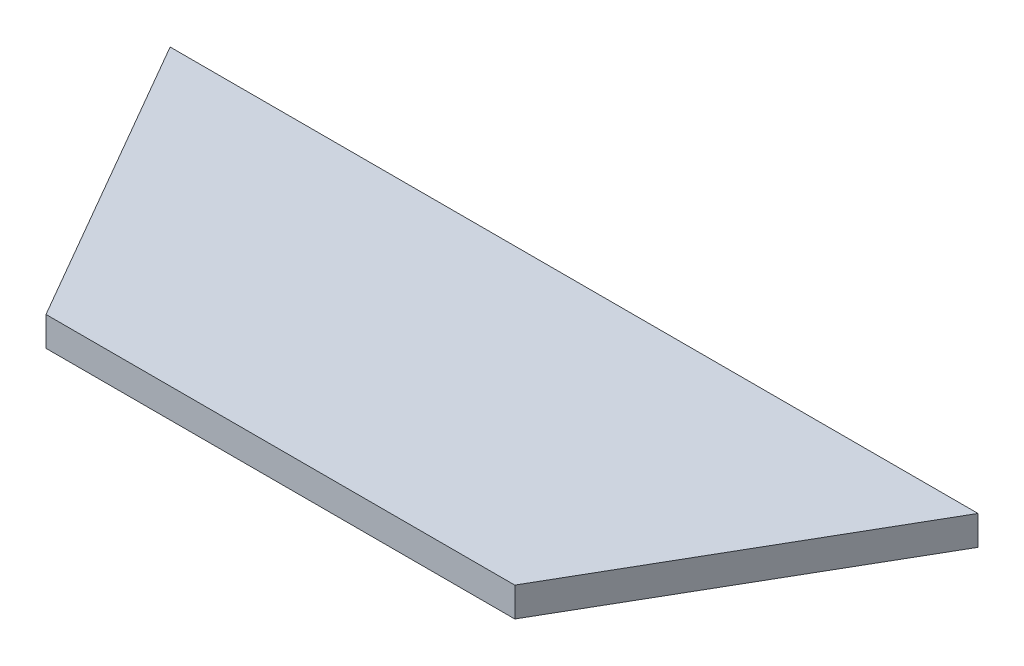
ISO-10303-21;
HEADER;
FILE_DESCRIPTION(('STEP AP214'),'2;1');
FILE_NAME('part.step','',(''),(''),'','','');
FILE_SCHEMA(('AUTOMOTIVE_DESIGN { 1 0 10303 214 1 1 1 1 }'));
ENDSEC;
DATA;
#1=APPLICATION_CONTEXT('core data for automotive mechanical design processes');
#2=APPLICATION_PROTOCOL_DEFINITION('international standard','automotive_design',2000,#1);
#3=PRODUCT_CONTEXT('',#1,'mechanical');
#4=PRODUCT('Part','Part','',(#3));
#5=PRODUCT_RELATED_PRODUCT_CATEGORY('part','',(#4));
#6=PRODUCT_DEFINITION_FORMATION('','',#4);
#7=PRODUCT_DEFINITION_CONTEXT('part definition',#1,'design');
#8=PRODUCT_DEFINITION('design','',#6,#7);
#9=PRODUCT_DEFINITION_SHAPE('','',#8);
#10=(LENGTH_UNIT() NAMED_UNIT(*) SI_UNIT(.MILLI.,.METRE.));
#11=(NAMED_UNIT(*) PLANE_ANGLE_UNIT() SI_UNIT($,.RADIAN.));
#12=(NAMED_UNIT(*) SI_UNIT($,.STERADIAN.) SOLID_ANGLE_UNIT());
#13=UNCERTAINTY_MEASURE_WITH_UNIT(LENGTH_MEASURE(1.E-05),#10,'distance_accuracy_value','');
#14=(GEOMETRIC_REPRESENTATION_CONTEXT(3) GLOBAL_UNCERTAINTY_ASSIGNED_CONTEXT((#13)) GLOBAL_UNIT_ASSIGNED_CONTEXT((#10,
#11,#12)) REPRESENTATION_CONTEXT('',''));
#15=CARTESIAN_POINT('',(0.,0.,0.));
#16=DIRECTION('',(0.,0.,1.));
#17=DIRECTION('',(1.,0.,0.));
#18=AXIS2_PLACEMENT_3D('',#15,#16,#17);
#19=CARTESIAN_POINT('',(-28.8675134594811,5.,-50.));
#20=DIRECTION('',(0.86602540378444,0.,-0.499999999999998));
#21=DIRECTION('',(-0.499999999999998,0.,-0.86602540378444));
#22=AXIS2_PLACEMENT_3D('',#19,#20,#21);
#23=PLANE('',#22);
#24=DIRECTION('',(0.499999999999998,0.,0.86602540378444));
#25=VECTOR('',#24,1.);
#26=CARTESIAN_POINT('',(-28.8675134594811,0.,-50.));
#27=LINE('',#26,#25);
#28=CARTESIAN_POINT('',(-28.8675134594811,0.,-50.));
#29=VERTEX_POINT('',#28);
#30=CARTESIAN_POINT('',(0.,0.,0.));
#31=VERTEX_POINT('',#30);
#32=EDGE_CURVE('E96',#29,#31,#27,.T.);
#33=ORIENTED_EDGE('',*,*,#32,.T.);
#34=DIRECTION('',(0.,-1.,0.));
#35=VECTOR('',#34,1.);
#36=CARTESIAN_POINT('',(0.,5.,0.));
#37=LINE('',#36,#35);
#38=CARTESIAN_POINT('',(0.,5.,0.));
#39=VERTEX_POINT('',#38);
#40=EDGE_CURVE('E11',#39,#31,#37,.T.);
#41=ORIENTED_EDGE('',*,*,#40,.F.);
#42=DIRECTION('',(0.499999999999998,0.,0.86602540378444));
#43=VECTOR('',#42,1.);
#44=CARTESIAN_POINT('',(-28.8675134594811,5.,-50.));
#45=LINE('',#44,#43);
#46=CARTESIAN_POINT('',(-28.8675134594811,5.,-50.));
#47=VERTEX_POINT('',#46);
#48=EDGE_CURVE('E84',#47,#39,#45,.T.);
#49=ORIENTED_EDGE('',*,*,#48,.F.);
#50=DIRECTION('',(0.,-1.,0.));
#51=VECTOR('',#50,1.);
#52=CARTESIAN_POINT('',(-28.8675134594811,5.,-50.));
#53=LINE('',#52,#51);
#54=EDGE_CURVE('E92',#47,#29,#53,.T.);
#55=ORIENTED_EDGE('',*,*,#54,.T.);
#56=EDGE_LOOP('',(#33,#41,#49,#55));
#57=FACE_BOUND('',#56,.T.);
#58=ADVANCED_FACE('F33',(#57),#23,.F.);
#59=CARTESIAN_POINT('',(0.,5.,0.));
#60=DIRECTION('',(0.,0.,-1.));
#61=DIRECTION('',(-1.,0.,0.));
#62=AXIS2_PLACEMENT_3D('',#59,#60,#61);
#63=PLANE('',#62);
#64=DIRECTION('',(1.,0.,0.));
#65=VECTOR('',#64,1.);
#66=CARTESIAN_POINT('',(0.,0.,0.));
#67=LINE('',#66,#65);
#68=CARTESIAN_POINT('',(79.81197846,0.,0.));
#69=VERTEX_POINT('',#68);
#70=EDGE_CURVE('E88',#31,#69,#67,.T.);
#71=ORIENTED_EDGE('',*,*,#70,.T.);
#72=DIRECTION('',(0.,-1.,0.));
#73=VECTOR('',#72,1.);
#74=CARTESIAN_POINT('',(79.81197846,5.,0.));
#75=LINE('',#74,#73);
#76=CARTESIAN_POINT('',(79.81197846,5.,0.));
#77=VERTEX_POINT('',#76);
#78=EDGE_CURVE('E41',#77,#69,#75,.T.);
#79=ORIENTED_EDGE('',*,*,#78,.F.);
#80=DIRECTION('',(1.,0.,0.));
#81=VECTOR('',#80,1.);
#82=CARTESIAN_POINT('',(0.,5.,0.));
#83=LINE('',#82,#81);
#84=EDGE_CURVE('E79',#39,#77,#83,.T.);
#85=ORIENTED_EDGE('',*,*,#84,.F.);
#86=ORIENTED_EDGE('',*,*,#40,.T.);
#87=EDGE_LOOP('',(#71,#79,#85,#86));
#88=FACE_BOUND('',#87,.T.);
#89=ADVANCED_FACE('F87',(#88),#63,.F.);
#90=CARTESIAN_POINT('',(79.81197846,5.,0.));
#91=DIRECTION('',(-0.86602540378444,0.,-0.499999999999998));
#92=DIRECTION('',(-0.499999999999998,0.,0.86602540378444));
#93=AXIS2_PLACEMENT_3D('',#90,#91,#92);
#94=PLANE('',#93);
#95=DIRECTION('',(0.499999999999998,0.,-0.86602540378444));
#96=VECTOR('',#95,1.);
#97=CARTESIAN_POINT('',(79.81197846,0.,0.));
#98=LINE('',#97,#96);
#99=CARTESIAN_POINT('',(108.679491919481,0.,-50.));
#100=VERTEX_POINT('',#99);
#101=EDGE_CURVE('E66',#69,#100,#98,.T.);
#102=ORIENTED_EDGE('',*,*,#101,.T.);
#103=DIRECTION('',(0.,-1.,0.));
#104=VECTOR('',#103,1.);
#105=CARTESIAN_POINT('',(108.679491919481,5.,-50.));
#106=LINE('',#105,#104);
#107=CARTESIAN_POINT('',(108.679491919481,5.,-50.));
#108=VERTEX_POINT('',#107);
#109=EDGE_CURVE('E89',#108,#100,#106,.T.);
#110=ORIENTED_EDGE('',*,*,#109,.F.);
#111=DIRECTION('',(0.499999999999998,0.,-0.86602540378444));
#112=VECTOR('',#111,1.);
#113=CARTESIAN_POINT('',(79.81197846,5.,0.));
#114=LINE('',#113,#112);
#115=EDGE_CURVE('E82',#77,#108,#114,.T.);
#116=ORIENTED_EDGE('',*,*,#115,.F.);
#117=ORIENTED_EDGE('',*,*,#78,.T.);
#118=EDGE_LOOP('',(#102,#110,#116,#117));
#119=FACE_BOUND('',#118,.T.);
#120=ADVANCED_FACE('F90',(#119),#94,.F.);
#121=CARTESIAN_POINT('',(108.679491919481,5.,-50.));
#122=DIRECTION('',(0.,0.,1.));
#123=DIRECTION('',(1.,0.,0.));
#124=AXIS2_PLACEMENT_3D('',#121,#122,#123);
#125=PLANE('',#124);
#126=DIRECTION('',(-1.,0.,0.));
#127=VECTOR('',#126,1.);
#128=CARTESIAN_POINT('',(108.679491919481,0.,-50.));
#129=LINE('',#128,#127);
#130=EDGE_CURVE('E72',#100,#29,#129,.T.);
#131=ORIENTED_EDGE('',*,*,#130,.T.);
#132=ORIENTED_EDGE('',*,*,#54,.F.);
#133=DIRECTION('',(-1.,0.,0.));
#134=VECTOR('',#133,1.);
#135=CARTESIAN_POINT('',(108.679491919481,5.,-50.));
#136=LINE('',#135,#134);
#137=EDGE_CURVE('E49',#108,#47,#136,.T.);
#138=ORIENTED_EDGE('',*,*,#137,.F.);
#139=ORIENTED_EDGE('',*,*,#109,.T.);
#140=EDGE_LOOP('',(#131,#132,#138,#139));
#141=FACE_BOUND('',#140,.T.);
#142=ADVANCED_FACE('F103',(#141),#125,.F.);
#143=CARTESIAN_POINT('',(0.,5.,0.));
#144=DIRECTION('',(0.,1.,0.));
#145=DIRECTION('',(0.,0.,1.));
#146=AXIS2_PLACEMENT_3D('',#143,#144,#145);
#147=PLANE('',#146);
#148=ORIENTED_EDGE('',*,*,#48,.T.);
#149=ORIENTED_EDGE('',*,*,#84,.T.);
#150=ORIENTED_EDGE('',*,*,#115,.T.);
#151=ORIENTED_EDGE('',*,*,#137,.T.);
#152=EDGE_LOOP('',(#148,#149,#150,#151));
#153=FACE_BOUND('',#152,.T.);
#154=ADVANCED_FACE('F80',(#153),#147,.T.);
#155=CARTESIAN_POINT('',(0.,0.,0.));
#156=DIRECTION('',(0.,1.,0.));
#157=DIRECTION('',(0.,0.,1.));
#158=AXIS2_PLACEMENT_3D('',#155,#156,#157);
#159=PLANE('',#158);
#160=ORIENTED_EDGE('',*,*,#32,.F.);
#161=ORIENTED_EDGE('',*,*,#130,.F.);
#162=ORIENTED_EDGE('',*,*,#101,.F.);
#163=ORIENTED_EDGE('',*,*,#70,.F.);
#164=EDGE_LOOP('',(#160,#161,#162,#163));
#165=FACE_BOUND('',#164,.T.);
#166=ADVANCED_FACE('F106',(#165),#159,.F.);
#167=CLOSED_SHELL('',(#58,#89,#120,#142,#154,#166));
#168=MANIFOLD_SOLID_BREP('B2',#167);
#169=ADVANCED_BREP_SHAPE_REPRESENTATION('',(#18,#168),#14);
#170=SHAPE_DEFINITION_REPRESENTATION(#9,#169);
ENDSEC;
END-ISO-10303-21;
